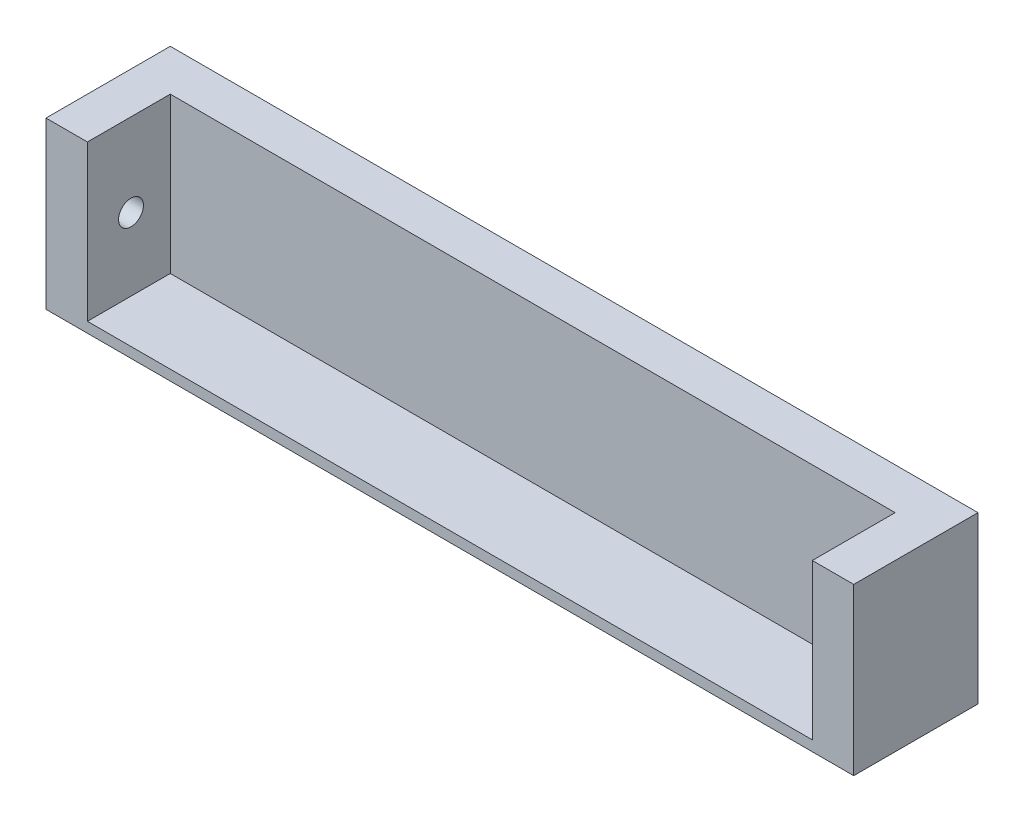
ISO-10303-21;
HEADER;
FILE_DESCRIPTION(('STEP AP214'),'2;1');
FILE_NAME('part.step','',(''),(''),'','','');
FILE_SCHEMA(('AUTOMOTIVE_DESIGN { 1 0 10303 214 1 1 1 1 }'));
ENDSEC;
DATA;
#1=APPLICATION_CONTEXT('core data for automotive mechanical design processes');
#2=APPLICATION_PROTOCOL_DEFINITION('international standard','automotive_design',2000,#1);
#3=PRODUCT_CONTEXT('',#1,'mechanical');
#4=PRODUCT('Part','Part','',(#3));
#5=PRODUCT_RELATED_PRODUCT_CATEGORY('part','',(#4));
#6=PRODUCT_DEFINITION_FORMATION('','',#4);
#7=PRODUCT_DEFINITION_CONTEXT('part definition',#1,'design');
#8=PRODUCT_DEFINITION('design','',#6,#7);
#9=PRODUCT_DEFINITION_SHAPE('','',#8);
#10=(LENGTH_UNIT() NAMED_UNIT(*) SI_UNIT(.MILLI.,.METRE.));
#11=(NAMED_UNIT(*) PLANE_ANGLE_UNIT() SI_UNIT($,.RADIAN.));
#12=(NAMED_UNIT(*) SI_UNIT($,.STERADIAN.) SOLID_ANGLE_UNIT());
#13=UNCERTAINTY_MEASURE_WITH_UNIT(LENGTH_MEASURE(1.E-05),#10,'distance_accuracy_value','');
#14=(GEOMETRIC_REPRESENTATION_CONTEXT(3) GLOBAL_UNCERTAINTY_ASSIGNED_CONTEXT((#13)) GLOBAL_UNIT_ASSIGNED_CONTEXT((#10,
#11,#12)) REPRESENTATION_CONTEXT('',''));
#15=CARTESIAN_POINT('',(0.,0.,0.));
#16=DIRECTION('',(0.,0.,1.));
#17=DIRECTION('',(1.,0.,0.));
#18=AXIS2_PLACEMENT_3D('',#15,#16,#17);
#19=CARTESIAN_POINT('',(0.,0.,60.));
#20=DIRECTION('',(1.,0.,0.));
#21=DIRECTION('',(0.,0.,-1.));
#22=AXIS2_PLACEMENT_3D('',#19,#20,#21);
#23=PLANE('',#22);
#24=DIRECTION('',(0.,-1.,0.));
#25=VECTOR('',#24,1.);
#26=CARTESIAN_POINT('',(0.,0.,0.));
#27=LINE('',#26,#25);
#28=CARTESIAN_POINT('',(0.,80.,0.));
#29=VERTEX_POINT('',#28);
#30=CARTESIAN_POINT('',(0.,0.,0.));
#31=VERTEX_POINT('',#30);
#32=EDGE_CURVE('E145',#29,#31,#27,.T.);
#33=ORIENTED_EDGE('',*,*,#32,.T.);
#34=DIRECTION('',(0.,0.,-1.));
#35=VECTOR('',#34,1.);
#36=CARTESIAN_POINT('',(0.,0.,60.));
#37=LINE('',#36,#35);
#38=CARTESIAN_POINT('',(0.,0.,60.));
#39=VERTEX_POINT('',#38);
#40=EDGE_CURVE('E11',#39,#31,#37,.T.);
#41=ORIENTED_EDGE('',*,*,#40,.F.);
#42=DIRECTION('',(0.,-1.,0.));
#43=VECTOR('',#42,1.);
#44=CARTESIAN_POINT('',(0.,0.,60.));
#45=LINE('',#44,#43);
#46=CARTESIAN_POINT('',(0.,80.,60.));
#47=VERTEX_POINT('',#46);
#48=EDGE_CURVE('E150',#47,#39,#45,.T.);
#49=ORIENTED_EDGE('',*,*,#48,.F.);
#50=DIRECTION('',(0.,0.,-1.));
#51=VECTOR('',#50,1.);
#52=CARTESIAN_POINT('',(0.,80.,60.));
#53=LINE('',#52,#51);
#54=EDGE_CURVE('E158',#47,#29,#53,.T.);
#55=ORIENTED_EDGE('',*,*,#54,.T.);
#56=EDGE_LOOP('',(#33,#41,#49,#55));
#57=FACE_BOUND('',#56,.T.);
#58=ADVANCED_FACE('F37',(#57),#23,.F.);
#59=CARTESIAN_POINT('',(0.,0.,60.));
#60=DIRECTION('',(0.,1.,0.));
#61=DIRECTION('',(0.,0.,1.));
#62=AXIS2_PLACEMENT_3D('',#59,#60,#61);
#63=PLANE('',#62);
#64=DIRECTION('',(1.,0.,0.));
#65=VECTOR('',#64,1.);
#66=CARTESIAN_POINT('',(0.,0.,0.));
#67=LINE('',#66,#65);
#68=CARTESIAN_POINT('',(390.,0.,0.));
#69=VERTEX_POINT('',#68);
#70=EDGE_CURVE('E161',#31,#69,#67,.T.);
#71=ORIENTED_EDGE('',*,*,#70,.T.);
#72=DIRECTION('',(0.,0.,-1.));
#73=VECTOR('',#72,1.);
#74=CARTESIAN_POINT('',(390.,0.,60.));
#75=LINE('',#74,#73);
#76=CARTESIAN_POINT('',(390.,0.,60.));
#77=VERTEX_POINT('',#76);
#78=EDGE_CURVE('E45',#77,#69,#75,.T.);
#79=ORIENTED_EDGE('',*,*,#78,.F.);
#80=DIRECTION('',(1.,0.,0.));
#81=VECTOR('',#80,1.);
#82=CARTESIAN_POINT('',(0.,0.,60.));
#83=LINE('',#82,#81);
#84=EDGE_CURVE('E89',#39,#77,#83,.T.);
#85=ORIENTED_EDGE('',*,*,#84,.F.);
#86=ORIENTED_EDGE('',*,*,#40,.T.);
#87=EDGE_LOOP('',(#71,#79,#85,#86));
#88=FACE_BOUND('',#87,.T.);
#89=ADVANCED_FACE('F200',(#88),#63,.F.);
#90=CARTESIAN_POINT('',(390.,0.,60.));
#91=DIRECTION('',(-1.,0.,0.));
#92=DIRECTION('',(0.,0.,1.));
#93=AXIS2_PLACEMENT_3D('',#90,#91,#92);
#94=PLANE('',#93);
#95=DIRECTION('',(0.,1.,0.));
#96=VECTOR('',#95,1.);
#97=CARTESIAN_POINT('',(390.,0.,0.));
#98=LINE('',#97,#96);
#99=CARTESIAN_POINT('',(390.,80.,0.));
#100=VERTEX_POINT('',#99);
#101=EDGE_CURVE('E163',#69,#100,#98,.T.);
#102=ORIENTED_EDGE('',*,*,#101,.T.);
#103=DIRECTION('',(0.,0.,-1.));
#104=VECTOR('',#103,1.);
#105=CARTESIAN_POINT('',(390.,80.,60.));
#106=LINE('',#105,#104);
#107=CARTESIAN_POINT('',(390.,80.,60.));
#108=VERTEX_POINT('',#107);
#109=EDGE_CURVE('E167',#108,#100,#106,.T.);
#110=ORIENTED_EDGE('',*,*,#109,.F.);
#111=DIRECTION('',(0.,1.,0.));
#112=VECTOR('',#111,1.);
#113=CARTESIAN_POINT('',(390.,0.,60.));
#114=LINE('',#113,#112);
#115=EDGE_CURVE('E153',#77,#108,#114,.T.);
#116=ORIENTED_EDGE('',*,*,#115,.F.);
#117=ORIENTED_EDGE('',*,*,#78,.T.);
#118=EDGE_LOOP('',(#102,#110,#116,#117));
#119=FACE_BOUND('',#118,.T.);
#120=ADVANCED_FACE('F173',(#119),#94,.F.);
#121=CARTESIAN_POINT('',(0.,80.,60.));
#122=DIRECTION('',(0.,-1.,0.));
#123=DIRECTION('',(0.,0.,-1.));
#124=AXIS2_PLACEMENT_3D('',#121,#122,#123);
#125=PLANE('',#124);
#126=DIRECTION('',(-1.,0.,0.));
#127=VECTOR('',#126,1.);
#128=CARTESIAN_POINT('',(0.,80.,60.));
#129=LINE('',#128,#127);
#130=CARTESIAN_POINT('',(20.,80.,60.));
#131=VERTEX_POINT('',#130);
#132=EDGE_CURVE('E60',#131,#47,#129,.T.);
#133=ORIENTED_EDGE('',*,*,#132,.F.);
#134=DIRECTION('',(0.,0.,1.));
#135=VECTOR('',#134,1.);
#136=CARTESIAN_POINT('',(20.,80.,20.));
#137=LINE('',#136,#135);
#138=CARTESIAN_POINT('',(20.,80.,20.));
#139=VERTEX_POINT('',#138);
#140=EDGE_CURVE('E143',#139,#131,#137,.T.);
#141=ORIENTED_EDGE('',*,*,#140,.F.);
#142=DIRECTION('',(-1.,0.,0.));
#143=VECTOR('',#142,1.);
#144=CARTESIAN_POINT('',(20.,80.,20.));
#145=LINE('',#144,#143);
#146=CARTESIAN_POINT('',(370.,80.,20.));
#147=VERTEX_POINT('',#146);
#148=EDGE_CURVE('E118',#147,#139,#145,.T.);
#149=ORIENTED_EDGE('',*,*,#148,.F.);
#150=DIRECTION('',(0.,0.,1.));
#151=VECTOR('',#150,1.);
#152=CARTESIAN_POINT('',(370.,80.,20.));
#153=LINE('',#152,#151);
#154=CARTESIAN_POINT('',(370.,80.,60.));
#155=VERTEX_POINT('',#154);
#156=EDGE_CURVE('E146',#147,#155,#153,.T.);
#157=ORIENTED_EDGE('',*,*,#156,.T.);
#158=EDGE_CURVE('E155',#108,#155,#129,.T.);
#159=ORIENTED_EDGE('',*,*,#158,.F.);
#160=ORIENTED_EDGE('',*,*,#109,.T.);
#161=DIRECTION('',(-1.,0.,0.));
#162=VECTOR('',#161,1.);
#163=CARTESIAN_POINT('',(0.,80.,0.));
#164=LINE('',#163,#162);
#165=EDGE_CURVE('E82',#100,#29,#164,.T.);
#166=ORIENTED_EDGE('',*,*,#165,.T.);
#167=ORIENTED_EDGE('',*,*,#54,.F.);
#168=EDGE_LOOP('',(#133,#141,#149,#157,#159,#160,#166,#167));
#169=FACE_BOUND('',#168,.T.);
#170=ADVANCED_FACE('F181',(#169),#125,.F.);
#171=CARTESIAN_POINT('',(0.,0.,60.));
#172=DIRECTION('',(0.,0.,-1.));
#173=DIRECTION('',(-1.,0.,0.));
#174=AXIS2_PLACEMENT_3D('',#171,#172,#173);
#175=PLANE('',#174);
#176=DIRECTION('',(1.,0.,0.));
#177=VECTOR('',#176,1.);
#178=CARTESIAN_POINT('',(20.,4.99999999999996,60.));
#179=LINE('',#178,#177);
#180=CARTESIAN_POINT('',(20.,4.99999999999996,60.));
#181=VERTEX_POINT('',#180);
#182=CARTESIAN_POINT('',(370.,4.99999999999996,60.));
#183=VERTEX_POINT('',#182);
#184=EDGE_CURVE('E133',#181,#183,#179,.T.);
#185=ORIENTED_EDGE('',*,*,#184,.F.);
#186=DIRECTION('',(0.,-1.,0.));
#187=VECTOR('',#186,1.);
#188=CARTESIAN_POINT('',(20.,80.,60.));
#189=LINE('',#188,#187);
#190=EDGE_CURVE('E52',#131,#181,#189,.T.);
#191=ORIENTED_EDGE('',*,*,#190,.F.);
#192=ORIENTED_EDGE('',*,*,#132,.T.);
#193=ORIENTED_EDGE('',*,*,#48,.T.);
#194=ORIENTED_EDGE('',*,*,#84,.T.);
#195=ORIENTED_EDGE('',*,*,#115,.T.);
#196=ORIENTED_EDGE('',*,*,#158,.T.);
#197=DIRECTION('',(0.,1.,0.));
#198=VECTOR('',#197,1.);
#199=CARTESIAN_POINT('',(370.,80.,60.));
#200=LINE('',#199,#198);
#201=EDGE_CURVE('E131',#183,#155,#200,.T.);
#202=ORIENTED_EDGE('',*,*,#201,.F.);
#203=EDGE_LOOP('',(#185,#191,#192,#193,#194,#195,#196,#202));
#204=FACE_BOUND('',#203,.T.);
#205=ADVANCED_FACE('F182',(#204),#175,.F.);
#206=CARTESIAN_POINT('',(0.,0.,0.));
#207=DIRECTION('',(0.,0.,-1.));
#208=DIRECTION('',(-1.,0.,0.));
#209=AXIS2_PLACEMENT_3D('',#206,#207,#208);
#210=PLANE('',#209);
#211=ORIENTED_EDGE('',*,*,#32,.F.);
#212=ORIENTED_EDGE('',*,*,#165,.F.);
#213=ORIENTED_EDGE('',*,*,#101,.F.);
#214=ORIENTED_EDGE('',*,*,#70,.F.);
#215=EDGE_LOOP('',(#211,#212,#213,#214));
#216=FACE_BOUND('',#215,.T.);
#217=ADVANCED_FACE('F177',(#216),#210,.T.);
#218=CARTESIAN_POINT('',(20.,80.,20.));
#219=DIRECTION('',(-1.,0.,0.));
#220=DIRECTION('',(0.,-1.,0.));
#221=AXIS2_PLACEMENT_3D('',#218,#219,#220);
#222=PLANE('',#221);
#223=CARTESIAN_POINT('',(20.,40.,38.9576891447803));
#224=DIRECTION('',(-1.,0.,0.));
#225=DIRECTION('',(0.,-1.,0.));
#226=AXIS2_PLACEMENT_3D('',#223,#224,#225);
#227=CIRCLE('',#226,6.);
#228=CARTESIAN_POINT('',(20.,34.,38.9576891447803));
#229=VERTEX_POINT('',#228);
#230=EDGE_CURVE('E136',#229,#229,#227,.F.);
#231=ORIENTED_EDGE('',*,*,#230,.F.);
#232=EDGE_LOOP('',(#231));
#233=FACE_BOUND('',#232,.T.);
#234=ORIENTED_EDGE('',*,*,#190,.T.);
#235=DIRECTION('',(0.,0.,1.));
#236=VECTOR('',#235,1.);
#237=CARTESIAN_POINT('',(20.,4.99999999999996,20.));
#238=LINE('',#237,#236);
#239=CARTESIAN_POINT('',(20.,4.99999999999996,20.));
#240=VERTEX_POINT('',#239);
#241=EDGE_CURVE('E108',#240,#181,#238,.T.);
#242=ORIENTED_EDGE('',*,*,#241,.F.);
#243=DIRECTION('',(0.,-1.,0.));
#244=VECTOR('',#243,1.);
#245=CARTESIAN_POINT('',(20.,80.,20.));
#246=LINE('',#245,#244);
#247=EDGE_CURVE('E112',#139,#240,#246,.T.);
#248=ORIENTED_EDGE('',*,*,#247,.F.);
#249=ORIENTED_EDGE('',*,*,#140,.T.);
#250=EDGE_LOOP('',(#234,#242,#248,#249));
#251=FACE_BOUND('',#250,.T.);
#252=ADVANCED_FACE('F110',(#233,#251),#222,.F.);
#253=CARTESIAN_POINT('',(370.,80.,20.));
#254=DIRECTION('',(1.,0.,0.));
#255=DIRECTION('',(0.,0.,-1.));
#256=AXIS2_PLACEMENT_3D('',#253,#254,#255);
#257=PLANE('',#256);
#258=CARTESIAN_POINT('',(370.,40.,38.9576891447803));
#259=DIRECTION('',(1.,0.,0.));
#260=DIRECTION('',(0.,0.,-1.));
#261=AXIS2_PLACEMENT_3D('',#258,#259,#260);
#262=CIRCLE('',#261,6.);
#263=CARTESIAN_POINT('',(370.,40.,32.9576891447803));
#264=VERTEX_POINT('',#263);
#265=EDGE_CURVE('E40',#264,#264,#262,.F.);
#266=ORIENTED_EDGE('',*,*,#265,.F.);
#267=EDGE_LOOP('',(#266));
#268=FACE_BOUND('',#267,.T.);
#269=ORIENTED_EDGE('',*,*,#201,.T.);
#270=ORIENTED_EDGE('',*,*,#156,.F.);
#271=DIRECTION('',(0.,1.,0.));
#272=VECTOR('',#271,1.);
#273=CARTESIAN_POINT('',(370.,80.,20.));
#274=LINE('',#273,#272);
#275=CARTESIAN_POINT('',(370.,4.99999999999996,20.));
#276=VERTEX_POINT('',#275);
#277=EDGE_CURVE('E126',#276,#147,#274,.T.);
#278=ORIENTED_EDGE('',*,*,#277,.F.);
#279=DIRECTION('',(0.,0.,1.));
#280=VECTOR('',#279,1.);
#281=CARTESIAN_POINT('',(370.,4.99999999999996,20.));
#282=LINE('',#281,#280);
#283=EDGE_CURVE('E117',#276,#183,#282,.T.);
#284=ORIENTED_EDGE('',*,*,#283,.T.);
#285=EDGE_LOOP('',(#269,#270,#278,#284));
#286=FACE_BOUND('',#285,.T.);
#287=ADVANCED_FACE('F186',(#268,#286),#257,.F.);
#288=CARTESIAN_POINT('',(20.,4.99999999999996,20.));
#289=DIRECTION('',(0.,-1.,0.));
#290=DIRECTION('',(0.,0.,-1.));
#291=AXIS2_PLACEMENT_3D('',#288,#289,#290);
#292=PLANE('',#291);
#293=ORIENTED_EDGE('',*,*,#184,.T.);
#294=ORIENTED_EDGE('',*,*,#283,.F.);
#295=DIRECTION('',(1.,0.,0.));
#296=VECTOR('',#295,1.);
#297=CARTESIAN_POINT('',(20.,4.99999999999996,20.));
#298=LINE('',#297,#296);
#299=EDGE_CURVE('E121',#240,#276,#298,.T.);
#300=ORIENTED_EDGE('',*,*,#299,.F.);
#301=ORIENTED_EDGE('',*,*,#241,.T.);
#302=EDGE_LOOP('',(#293,#294,#300,#301));
#303=FACE_BOUND('',#302,.T.);
#304=ADVANCED_FACE('F122',(#303),#292,.F.);
#305=CARTESIAN_POINT('',(0.,0.,20.));
#306=DIRECTION('',(0.,0.,1.));
#307=DIRECTION('',(1.,0.,0.));
#308=AXIS2_PLACEMENT_3D('',#305,#306,#307);
#309=PLANE('',#308);
#310=ORIENTED_EDGE('',*,*,#247,.T.);
#311=ORIENTED_EDGE('',*,*,#299,.T.);
#312=ORIENTED_EDGE('',*,*,#277,.T.);
#313=ORIENTED_EDGE('',*,*,#148,.T.);
#314=EDGE_LOOP('',(#310,#311,#312,#313));
#315=FACE_BOUND('',#314,.T.);
#316=ADVANCED_FACE('F128',(#315),#309,.T.);
#317=CARTESIAN_POINT('',(380.,40.,38.9576891447803));
#318=DIRECTION('',(1.,0.,0.));
#319=DIRECTION('',(0.,1.,0.));
#320=AXIS2_PLACEMENT_3D('',#317,#318,#319);
#321=PLANE('',#320);
#322=CARTESIAN_POINT('',(380.,40.,38.9576891447803));
#323=DIRECTION('',(1.,0.,0.));
#324=DIRECTION('',(0.,1.,0.));
#325=AXIS2_PLACEMENT_3D('',#322,#323,#324);
#326=CIRCLE('',#325,6.);
#327=CARTESIAN_POINT('',(380.,46.,38.9576891447803));
#328=VERTEX_POINT('',#327);
#329=EDGE_CURVE('E339',#328,#328,#326,.T.);
#330=ORIENTED_EDGE('',*,*,#329,.F.);
#331=EDGE_LOOP('',(#330));
#332=FACE_BOUND('',#331,.T.);
#333=ADVANCED_FACE('F244',(#332),#321,.F.);
#334=CARTESIAN_POINT('',(380.,40.,38.9576891447803));
#335=DIRECTION('',(-1.,0.,0.));
#336=DIRECTION('',(0.,-1.,0.));
#337=AXIS2_PLACEMENT_3D('',#334,#335,#336);
#338=CYLINDRICAL_SURFACE('',#337,6.);
#339=ORIENTED_EDGE('',*,*,#329,.T.);
#340=EDGE_LOOP('',(#339));
#341=FACE_BOUND('',#340,.T.);
#342=ORIENTED_EDGE('',*,*,#265,.T.);
#343=EDGE_LOOP('',(#342));
#344=FACE_BOUND('',#343,.T.);
#345=ADVANCED_FACE('F249',(#341,#344),#338,.F.);
#346=CARTESIAN_POINT('',(10.,40.,38.9576891447803));
#347=DIRECTION('',(1.,0.,0.));
#348=DIRECTION('',(0.,1.,0.));
#349=AXIS2_PLACEMENT_3D('',#346,#347,#348);
#350=CIRCLE('',#349,6.);
#351=CARTESIAN_POINT('',(10.,46.,38.9576891447803));
#352=VERTEX_POINT('',#351);
#353=EDGE_CURVE('E338',#352,#352,#350,.T.);
#354=ORIENTED_EDGE('',*,*,#353,.F.);
#355=EDGE_LOOP('',(#354));
#356=FACE_BOUND('',#355,.T.);
#357=ORIENTED_EDGE('',*,*,#230,.T.);
#358=EDGE_LOOP('',(#357));
#359=FACE_BOUND('',#358,.T.);
#360=ADVANCED_FACE('F260',(#356,#359),#338,.F.);
#361=CARTESIAN_POINT('',(10.,40.,38.9576891447803));
#362=DIRECTION('',(1.,0.,0.));
#363=DIRECTION('',(0.,1.,0.));
#364=AXIS2_PLACEMENT_3D('',#361,#362,#363);
#365=PLANE('',#364);
#366=ORIENTED_EDGE('',*,*,#353,.T.);
#367=EDGE_LOOP('',(#366));
#368=FACE_BOUND('',#367,.T.);
#369=ADVANCED_FACE('F271',(#368),#365,.T.);
#370=CLOSED_SHELL('',(#58,#89,#120,#170,#205,#217,#252,#287,#304,#316,#333,#345,#360,#369));
#371=MANIFOLD_SOLID_BREP('B2',#370);
#372=ADVANCED_BREP_SHAPE_REPRESENTATION('',(#18,#371),#14);
#373=SHAPE_DEFINITION_REPRESENTATION(#9,#372);
ENDSEC;
END-ISO-10303-21;
